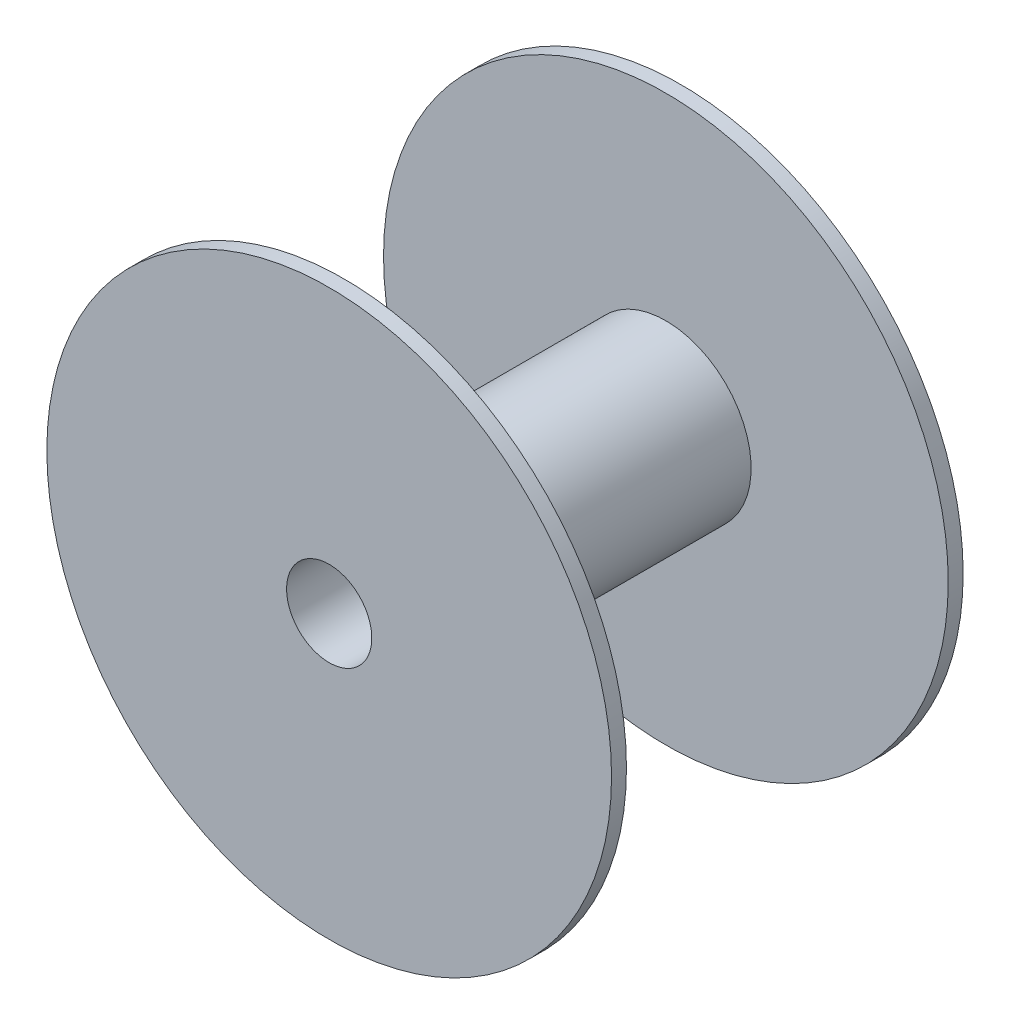
ISO-10303-21;
HEADER;
FILE_DESCRIPTION(('STEP AP214'),'2;1');
FILE_NAME('part.step','',(''),(''),'','','');
FILE_SCHEMA(('AUTOMOTIVE_DESIGN { 1 0 10303 214 1 1 1 1 }'));
ENDSEC;
DATA;
#1=APPLICATION_CONTEXT('core data for automotive mechanical design processes');
#2=APPLICATION_PROTOCOL_DEFINITION('international standard','automotive_design',2000,#1);
#3=PRODUCT_CONTEXT('',#1,'mechanical');
#4=PRODUCT('Part','Part','',(#3));
#5=PRODUCT_RELATED_PRODUCT_CATEGORY('part','',(#4));
#6=PRODUCT_DEFINITION_FORMATION('','',#4);
#7=PRODUCT_DEFINITION_CONTEXT('part definition',#1,'design');
#8=PRODUCT_DEFINITION('design','',#6,#7);
#9=PRODUCT_DEFINITION_SHAPE('','',#8);
#10=(LENGTH_UNIT() NAMED_UNIT(*) SI_UNIT(.MILLI.,.METRE.));
#11=(NAMED_UNIT(*) PLANE_ANGLE_UNIT() SI_UNIT($,.RADIAN.));
#12=(NAMED_UNIT(*) SI_UNIT($,.STERADIAN.) SOLID_ANGLE_UNIT());
#13=UNCERTAINTY_MEASURE_WITH_UNIT(LENGTH_MEASURE(1.E-05),#10,'distance_accuracy_value','');
#14=(GEOMETRIC_REPRESENTATION_CONTEXT(3) GLOBAL_UNCERTAINTY_ASSIGNED_CONTEXT((#13)) GLOBAL_UNIT_ASSIGNED_CONTEXT((#10,
#11,#12)) REPRESENTATION_CONTEXT('',''));
#15=CARTESIAN_POINT('',(0.,0.,0.));
#16=DIRECTION('',(0.,0.,1.));
#17=DIRECTION('',(1.,0.,0.));
#18=AXIS2_PLACEMENT_3D('',#15,#16,#17);
#19=CARTESIAN_POINT('',(0.,0.,302.));
#20=DIRECTION('',(0.,0.,-1.));
#21=DIRECTION('',(-1.,0.,0.));
#22=AXIS2_PLACEMENT_3D('',#19,#20,#21);
#23=CYLINDRICAL_SURFACE('',#22,80.);
#24=CARTESIAN_POINT('',(0.,0.,302.));
#25=DIRECTION('',(0.,0.,1.));
#26=DIRECTION('',(1.,0.,0.));
#27=AXIS2_PLACEMENT_3D('',#24,#25,#26);
#28=CIRCLE('',#27,80.);
#29=CARTESIAN_POINT('',(80.,0.,302.));
#30=VERTEX_POINT('',#29);
#31=EDGE_CURVE('E10',#30,#30,#28,.T.);
#32=ORIENTED_EDGE('',*,*,#31,.F.);
#33=EDGE_LOOP('',(#32));
#34=FACE_BOUND('',#33,.T.);
#35=CARTESIAN_POINT('',(0.,0.,0.));
#36=DIRECTION('',(0.,0.,-1.));
#37=DIRECTION('',(-1.,0.,0.));
#38=AXIS2_PLACEMENT_3D('',#35,#36,#37);
#39=CIRCLE('',#38,80.);
#40=CARTESIAN_POINT('',(-80.,0.,0.));
#41=VERTEX_POINT('',#40);
#42=EDGE_CURVE('E39',#41,#41,#39,.T.);
#43=ORIENTED_EDGE('',*,*,#42,.F.);
#44=EDGE_LOOP('',(#43));
#45=FACE_BOUND('',#44,.T.);
#46=ADVANCED_FACE('F33',(#34,#45),#23,.T.);
#47=CARTESIAN_POINT('',(0.,0.,0.));
#48=DIRECTION('',(0.,0.,-1.));
#49=DIRECTION('',(-1.,0.,0.));
#50=AXIS2_PLACEMENT_3D('',#47,#48,#49);
#51=PLANE('',#50);
#52=CARTESIAN_POINT('',(0.,0.,0.));
#53=DIRECTION('',(0.,0.,-1.));
#54=DIRECTION('',(-1.,0.,0.));
#55=AXIS2_PLACEMENT_3D('',#52,#53,#54);
#56=CIRCLE('',#55,265.);
#57=CARTESIAN_POINT('',(-265.,0.,0.));
#58=VERTEX_POINT('',#57);
#59=EDGE_CURVE('E47',#58,#58,#56,.T.);
#60=ORIENTED_EDGE('',*,*,#59,.F.);
#61=EDGE_LOOP('',(#60));
#62=FACE_BOUND('',#61,.T.);
#63=ORIENTED_EDGE('',*,*,#42,.T.);
#64=EDGE_LOOP('',(#63));
#65=FACE_BOUND('',#64,.T.);
#66=ADVANCED_FACE('F84',(#62,#65),#51,.F.);
#67=CARTESIAN_POINT('',(0.,0.,-14.));
#68=DIRECTION('',(0.,0.,1.));
#69=DIRECTION('',(1.,0.,0.));
#70=AXIS2_PLACEMENT_3D('',#67,#68,#69);
#71=CYLINDRICAL_SURFACE('',#70,265.);
#72=CARTESIAN_POINT('',(0.,0.,-14.));
#73=DIRECTION('',(0.,0.,-1.));
#74=DIRECTION('',(-1.,0.,0.));
#75=AXIS2_PLACEMENT_3D('',#72,#73,#74);
#76=CIRCLE('',#75,265.);
#77=CARTESIAN_POINT('',(-265.,0.,-14.));
#78=VERTEX_POINT('',#77);
#79=EDGE_CURVE('E43',#78,#78,#76,.T.);
#80=ORIENTED_EDGE('',*,*,#79,.F.);
#81=EDGE_LOOP('',(#80));
#82=FACE_BOUND('',#81,.T.);
#83=ORIENTED_EDGE('',*,*,#59,.T.);
#84=EDGE_LOOP('',(#83));
#85=FACE_BOUND('',#84,.T.);
#86=ADVANCED_FACE('F78',(#82,#85),#71,.T.);
#87=CARTESIAN_POINT('',(0.,0.,-14.));
#88=DIRECTION('',(0.,0.,-1.));
#89=DIRECTION('',(-1.,0.,0.));
#90=AXIS2_PLACEMENT_3D('',#87,#88,#89);
#91=PLANE('',#90);
#92=CARTESIAN_POINT('',(0.,0.,-14.));
#93=DIRECTION('',(0.,0.,-1.));
#94=DIRECTION('',(-1.,0.,0.));
#95=AXIS2_PLACEMENT_3D('',#92,#93,#94);
#96=CIRCLE('',#95,40.);
#97=CARTESIAN_POINT('',(-40.,0.,-14.));
#98=VERTEX_POINT('',#97);
#99=EDGE_CURVE('E59',#98,#98,#96,.T.);
#100=ORIENTED_EDGE('',*,*,#99,.F.);
#101=EDGE_LOOP('',(#100));
#102=FACE_BOUND('',#101,.T.);
#103=ORIENTED_EDGE('',*,*,#79,.T.);
#104=EDGE_LOOP('',(#103));
#105=FACE_BOUND('',#104,.T.);
#106=ADVANCED_FACE('F74',(#102,#105),#91,.T.);
#107=CARTESIAN_POINT('',(0.,0.,302.));
#108=DIRECTION('',(0.,0.,1.));
#109=DIRECTION('',(1.,0.,0.));
#110=AXIS2_PLACEMENT_3D('',#107,#108,#109);
#111=PLANE('',#110);
#112=CARTESIAN_POINT('',(0.,0.,302.));
#113=DIRECTION('',(0.,0.,1.));
#114=DIRECTION('',(1.,0.,0.));
#115=AXIS2_PLACEMENT_3D('',#112,#113,#114);
#116=CIRCLE('',#115,265.);
#117=CARTESIAN_POINT('',(265.,0.,302.));
#118=VERTEX_POINT('',#117);
#119=EDGE_CURVE('E53',#118,#118,#116,.T.);
#120=ORIENTED_EDGE('',*,*,#119,.F.);
#121=EDGE_LOOP('',(#120));
#122=FACE_BOUND('',#121,.T.);
#123=ORIENTED_EDGE('',*,*,#31,.T.);
#124=EDGE_LOOP('',(#123));
#125=FACE_BOUND('',#124,.T.);
#126=ADVANCED_FACE('F77',(#122,#125),#111,.F.);
#127=CARTESIAN_POINT('',(0.,0.,316.));
#128=DIRECTION('',(0.,0.,-1.));
#129=DIRECTION('',(-1.,0.,0.));
#130=AXIS2_PLACEMENT_3D('',#127,#128,#129);
#131=CYLINDRICAL_SURFACE('',#130,265.);
#132=CARTESIAN_POINT('',(0.,0.,316.));
#133=DIRECTION('',(0.,0.,1.));
#134=DIRECTION('',(1.,0.,0.));
#135=AXIS2_PLACEMENT_3D('',#132,#133,#134);
#136=CIRCLE('',#135,265.);
#137=CARTESIAN_POINT('',(265.,0.,316.));
#138=VERTEX_POINT('',#137);
#139=EDGE_CURVE('E51',#138,#138,#136,.T.);
#140=ORIENTED_EDGE('',*,*,#139,.F.);
#141=EDGE_LOOP('',(#140));
#142=FACE_BOUND('',#141,.T.);
#143=ORIENTED_EDGE('',*,*,#119,.T.);
#144=EDGE_LOOP('',(#143));
#145=FACE_BOUND('',#144,.T.);
#146=ADVANCED_FACE('F94',(#142,#145),#131,.T.);
#147=CARTESIAN_POINT('',(0.,0.,316.));
#148=DIRECTION('',(0.,0.,1.));
#149=DIRECTION('',(1.,0.,0.));
#150=AXIS2_PLACEMENT_3D('',#147,#148,#149);
#151=PLANE('',#150);
#152=CARTESIAN_POINT('',(0.,0.,316.));
#153=DIRECTION('',(0.,0.,-1.));
#154=DIRECTION('',(-1.,0.,0.));
#155=AXIS2_PLACEMENT_3D('',#152,#153,#154);
#156=CIRCLE('',#155,40.);
#157=CARTESIAN_POINT('',(-40.,0.,316.));
#158=VERTEX_POINT('',#157);
#159=EDGE_CURVE('E56',#158,#158,#156,.T.);
#160=ORIENTED_EDGE('',*,*,#159,.T.);
#161=EDGE_LOOP('',(#160));
#162=FACE_BOUND('',#161,.T.);
#163=ORIENTED_EDGE('',*,*,#139,.T.);
#164=EDGE_LOOP('',(#163));
#165=FACE_BOUND('',#164,.T.);
#166=ADVANCED_FACE('F65',(#162,#165),#151,.T.);
#167=CARTESIAN_POINT('',(0.,0.,316.));
#168=DIRECTION('',(0.,0.,-1.));
#169=DIRECTION('',(-1.,0.,0.));
#170=AXIS2_PLACEMENT_3D('',#167,#168,#169);
#171=CYLINDRICAL_SURFACE('',#170,40.);
#172=ORIENTED_EDGE('',*,*,#159,.F.);
#173=EDGE_LOOP('',(#172));
#174=FACE_BOUND('',#173,.T.);
#175=ORIENTED_EDGE('',*,*,#99,.T.);
#176=EDGE_LOOP('',(#175));
#177=FACE_BOUND('',#176,.T.);
#178=ADVANCED_FACE('F68',(#174,#177),#171,.F.);
#179=CLOSED_SHELL('',(#46,#66,#86,#106,#126,#146,#166,#178));
#180=MANIFOLD_SOLID_BREP('B2',#179);
#181=ADVANCED_BREP_SHAPE_REPRESENTATION('',(#18,#180),#14);
#182=SHAPE_DEFINITION_REPRESENTATION(#9,#181);
ENDSEC;
END-ISO-10303-21;
